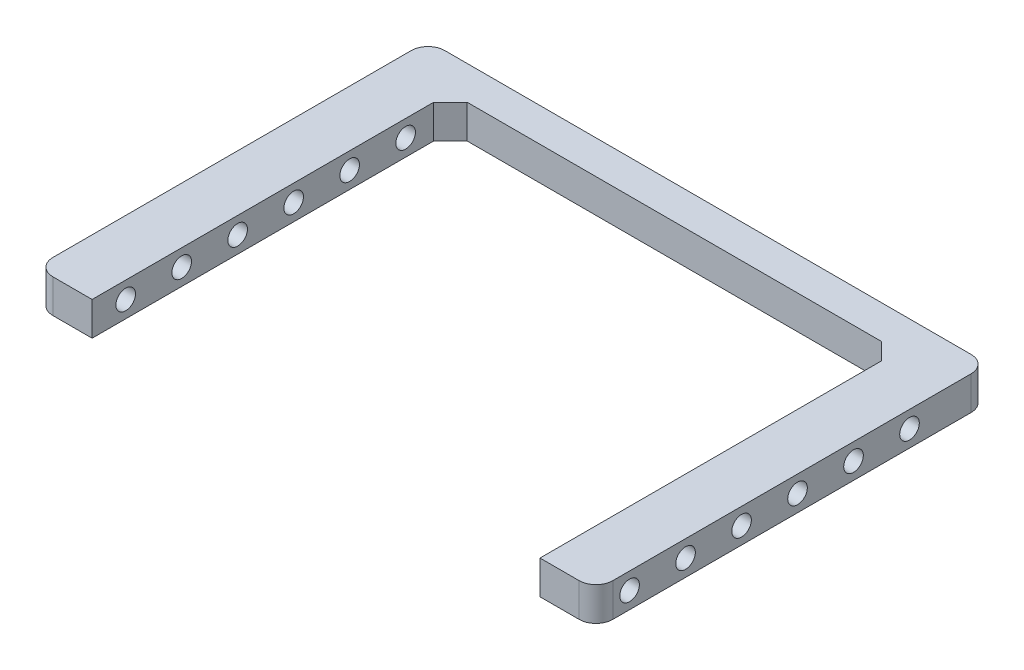
ISO-10303-21;
HEADER;
FILE_DESCRIPTION(('STEP AP214'),'2;1');
FILE_NAME('part.step','',(''),(''),'','','');
FILE_SCHEMA(('AUTOMOTIVE_DESIGN { 1 0 10303 214 1 1 1 1 }'));
ENDSEC;
DATA;
#1=APPLICATION_CONTEXT('core data for automotive mechanical design processes');
#2=APPLICATION_PROTOCOL_DEFINITION('international standard','automotive_design',2000,#1);
#3=PRODUCT_CONTEXT('',#1,'mechanical');
#4=PRODUCT('Part','Part','',(#3));
#5=PRODUCT_RELATED_PRODUCT_CATEGORY('part','',(#4));
#6=PRODUCT_DEFINITION_FORMATION('','',#4);
#7=PRODUCT_DEFINITION_CONTEXT('part definition',#1,'design');
#8=PRODUCT_DEFINITION('design','',#6,#7);
#9=PRODUCT_DEFINITION_SHAPE('','',#8);
#10=(LENGTH_UNIT() NAMED_UNIT(*) SI_UNIT(.MILLI.,.METRE.));
#11=(NAMED_UNIT(*) PLANE_ANGLE_UNIT() SI_UNIT($,.RADIAN.));
#12=(NAMED_UNIT(*) SI_UNIT($,.STERADIAN.) SOLID_ANGLE_UNIT());
#13=UNCERTAINTY_MEASURE_WITH_UNIT(LENGTH_MEASURE(1.E-05),#10,'distance_accuracy_value','');
#14=(GEOMETRIC_REPRESENTATION_CONTEXT(3) GLOBAL_UNCERTAINTY_ASSIGNED_CONTEXT((#13)) GLOBAL_UNIT_ASSIGNED_CONTEXT((#10,
#11,#12)) REPRESENTATION_CONTEXT('',''));
#15=CARTESIAN_POINT('',(0.,0.,0.));
#16=DIRECTION('',(0.,0.,1.));
#17=DIRECTION('',(1.,0.,0.));
#18=AXIS2_PLACEMENT_3D('',#15,#16,#17);
#19=CARTESIAN_POINT('',(25.,3.,21.));
#20=DIRECTION('',(-1.,0.,0.));
#21=DIRECTION('',(0.,0.,1.));
#22=AXIS2_PLACEMENT_3D('',#19,#20,#21);
#23=PLANE('',#22);
#24=CARTESIAN_POINT('',(25.,1.5,-7.));
#25=DIRECTION('',(-1.,0.,0.));
#26=DIRECTION('',(0.,0.,1.));
#27=AXIS2_PLACEMENT_3D('',#24,#25,#26);
#28=CIRCLE('',#27,0.875000000000002);
#29=CARTESIAN_POINT('',(25.,1.5,-6.125));
#30=VERTEX_POINT('',#29);
#31=EDGE_CURVE('E340',#30,#30,#28,.F.);
#32=ORIENTED_EDGE('',*,*,#31,.F.);
#33=EDGE_LOOP('',(#32));
#34=FACE_BOUND('',#33,.T.);
#35=CARTESIAN_POINT('',(25.,1.5,3.));
#36=DIRECTION('',(-1.,0.,0.));
#37=DIRECTION('',(0.,0.,1.));
#38=AXIS2_PLACEMENT_3D('',#35,#36,#37);
#39=CIRCLE('',#38,0.875);
#40=CARTESIAN_POINT('',(25.,1.5,3.875));
#41=VERTEX_POINT('',#40);
#42=EDGE_CURVE('E333',#41,#41,#39,.F.);
#43=ORIENTED_EDGE('',*,*,#42,.F.);
#44=EDGE_LOOP('',(#43));
#45=FACE_BOUND('',#44,.T.);
#46=CARTESIAN_POINT('',(25.,1.5,8.));
#47=DIRECTION('',(-1.,0.,0.));
#48=DIRECTION('',(0.,0.,1.));
#49=AXIS2_PLACEMENT_3D('',#46,#47,#48);
#50=CIRCLE('',#49,0.875);
#51=CARTESIAN_POINT('',(25.,1.5,8.875));
#52=VERTEX_POINT('',#51);
#53=EDGE_CURVE('E326',#52,#52,#50,.F.);
#54=ORIENTED_EDGE('',*,*,#53,.F.);
#55=EDGE_LOOP('',(#54));
#56=FACE_BOUND('',#55,.T.);
#57=CARTESIAN_POINT('',(25.,1.5,13.));
#58=DIRECTION('',(-1.,0.,0.));
#59=DIRECTION('',(0.,0.,1.));
#60=AXIS2_PLACEMENT_3D('',#57,#58,#59);
#61=CIRCLE('',#60,0.875);
#62=CARTESIAN_POINT('',(25.,1.5,13.875));
#63=VERTEX_POINT('',#62);
#64=EDGE_CURVE('E319',#63,#63,#61,.F.);
#65=ORIENTED_EDGE('',*,*,#64,.F.);
#66=EDGE_LOOP('',(#65));
#67=FACE_BOUND('',#66,.T.);
#68=CARTESIAN_POINT('',(25.,1.5,-2.));
#69=DIRECTION('',(-1.,0.,0.));
#70=DIRECTION('',(0.,0.,1.));
#71=AXIS2_PLACEMENT_3D('',#68,#69,#70);
#72=CIRCLE('',#71,0.875);
#73=CARTESIAN_POINT('',(25.,1.5,-1.125));
#74=VERTEX_POINT('',#73);
#75=EDGE_CURVE('E312',#74,#74,#72,.F.);
#76=ORIENTED_EDGE('',*,*,#75,.F.);
#77=EDGE_LOOP('',(#76));
#78=FACE_BOUND('',#77,.T.);
#79=CARTESIAN_POINT('',(25.,1.5,18.));
#80=DIRECTION('',(-1.,0.,0.));
#81=DIRECTION('',(0.,0.,1.));
#82=AXIS2_PLACEMENT_3D('',#79,#80,#81);
#83=CIRCLE('',#82,0.875000000000002);
#84=CARTESIAN_POINT('',(25.,1.5,18.875));
#85=VERTEX_POINT('',#84);
#86=EDGE_CURVE('E174',#85,#85,#83,.F.);
#87=ORIENTED_EDGE('',*,*,#86,.F.);
#88=EDGE_LOOP('',(#87));
#89=FACE_BOUND('',#88,.T.);
#90=DIRECTION('',(0.,0.,-1.));
#91=VECTOR('',#90,1.);
#92=CARTESIAN_POINT('',(25.,0.,21.));
#93=LINE('',#92,#91);
#94=CARTESIAN_POINT('',(25.,0.,19.5));
#95=VERTEX_POINT('',#94);
#96=CARTESIAN_POINT('',(25.,0.,-12.5));
#97=VERTEX_POINT('',#96);
#98=EDGE_CURVE('E170',#95,#97,#93,.T.);
#99=ORIENTED_EDGE('',*,*,#98,.T.);
#100=DIRECTION('',(0.,-1.,0.));
#101=VECTOR('',#100,1.);
#102=CARTESIAN_POINT('',(25.,3.,-12.5));
#103=LINE('',#102,#101);
#104=CARTESIAN_POINT('',(25.,3.,-12.5));
#105=VERTEX_POINT('',#104);
#106=EDGE_CURVE('E239',#97,#105,#103,.F.);
#107=ORIENTED_EDGE('',*,*,#106,.T.);
#108=DIRECTION('',(0.,0.,-1.));
#109=VECTOR('',#108,1.);
#110=CARTESIAN_POINT('',(25.,3.,21.));
#111=LINE('',#110,#109);
#112=CARTESIAN_POINT('',(25.,3.,19.5));
#113=VERTEX_POINT('',#112);
#114=EDGE_CURVE('E191',#113,#105,#111,.T.);
#115=ORIENTED_EDGE('',*,*,#114,.F.);
#116=DIRECTION('',(0.,-1.,0.));
#117=VECTOR('',#116,1.);
#118=CARTESIAN_POINT('',(25.,3.,19.5));
#119=LINE('',#118,#117);
#120=EDGE_CURVE('E236',#113,#95,#119,.T.);
#121=ORIENTED_EDGE('',*,*,#120,.T.);
#122=EDGE_LOOP('',(#99,#107,#115,#121));
#123=FACE_BOUND('',#122,.T.);
#124=ADVANCED_FACE('F32',(#34,#45,#56,#67,#78,#89,#123),#23,.F.);
#125=CARTESIAN_POINT('',(-25.,3.,-14.));
#126=DIRECTION('',(0.,0.,1.));
#127=DIRECTION('',(1.,0.,0.));
#128=AXIS2_PLACEMENT_3D('',#125,#126,#127);
#129=PLANE('',#128);
#130=DIRECTION('',(-1.,0.,0.));
#131=VECTOR('',#130,1.);
#132=CARTESIAN_POINT('',(-25.,3.,-14.));
#133=LINE('',#132,#131);
#134=CARTESIAN_POINT('',(23.5,3.,-14.));
#135=VERTEX_POINT('',#134);
#136=CARTESIAN_POINT('',(-23.5,3.,-14.));
#137=VERTEX_POINT('',#136);
#138=EDGE_CURVE('E301',#135,#137,#133,.T.);
#139=ORIENTED_EDGE('',*,*,#138,.F.);
#140=DIRECTION('',(0.,-1.,0.));
#141=VECTOR('',#140,1.);
#142=CARTESIAN_POINT('',(23.5,3.,-14.));
#143=LINE('',#142,#141);
#144=CARTESIAN_POINT('',(23.5,0.,-14.));
#145=VERTEX_POINT('',#144);
#146=EDGE_CURVE('E225',#135,#145,#143,.T.);
#147=ORIENTED_EDGE('',*,*,#146,.T.);
#148=DIRECTION('',(-1.,0.,0.));
#149=VECTOR('',#148,1.);
#150=CARTESIAN_POINT('',(-25.,0.,-14.));
#151=LINE('',#150,#149);
#152=CARTESIAN_POINT('',(-23.5,0.,-14.));
#153=VERTEX_POINT('',#152);
#154=EDGE_CURVE('E173',#145,#153,#151,.T.);
#155=ORIENTED_EDGE('',*,*,#154,.T.);
#156=DIRECTION('',(0.,-1.,0.));
#157=VECTOR('',#156,1.);
#158=CARTESIAN_POINT('',(-23.5,3.,-14.));
#159=LINE('',#158,#157);
#160=EDGE_CURVE('E154',#153,#137,#159,.F.);
#161=ORIENTED_EDGE('',*,*,#160,.T.);
#162=EDGE_LOOP('',(#139,#147,#155,#161));
#163=FACE_BOUND('',#162,.T.);
#164=ADVANCED_FACE('F298',(#163),#129,.F.);
#165=CARTESIAN_POINT('',(-25.,3.,21.));
#166=DIRECTION('',(1.,0.,0.));
#167=DIRECTION('',(0.,0.,-1.));
#168=AXIS2_PLACEMENT_3D('',#165,#166,#167);
#169=PLANE('',#168);
#170=CARTESIAN_POINT('',(-25.,1.5,-7.));
#171=DIRECTION('',(-1.,0.,0.));
#172=DIRECTION('',(0.,0.,1.));
#173=AXIS2_PLACEMENT_3D('',#170,#171,#172);
#174=CIRCLE('',#173,0.875000000000002);
#175=CARTESIAN_POINT('',(-25.,1.5,-6.125));
#176=VERTEX_POINT('',#175);
#177=EDGE_CURVE('E223',#176,#176,#174,.T.);
#178=ORIENTED_EDGE('',*,*,#177,.F.);
#179=EDGE_LOOP('',(#178));
#180=FACE_BOUND('',#179,.T.);
#181=CARTESIAN_POINT('',(-25.,1.5,3.));
#182=DIRECTION('',(-1.,0.,0.));
#183=DIRECTION('',(0.,0.,1.));
#184=AXIS2_PLACEMENT_3D('',#181,#182,#183);
#185=CIRCLE('',#184,0.875);
#186=CARTESIAN_POINT('',(-25.,1.5,3.875));
#187=VERTEX_POINT('',#186);
#188=EDGE_CURVE('E218',#187,#187,#185,.T.);
#189=ORIENTED_EDGE('',*,*,#188,.F.);
#190=EDGE_LOOP('',(#189));
#191=FACE_BOUND('',#190,.T.);
#192=CARTESIAN_POINT('',(-25.,1.5,8.));
#193=DIRECTION('',(-1.,0.,0.));
#194=DIRECTION('',(0.,0.,1.));
#195=AXIS2_PLACEMENT_3D('',#192,#193,#194);
#196=CIRCLE('',#195,0.875);
#197=CARTESIAN_POINT('',(-25.,1.5,8.875));
#198=VERTEX_POINT('',#197);
#199=EDGE_CURVE('E213',#198,#198,#196,.T.);
#200=ORIENTED_EDGE('',*,*,#199,.F.);
#201=EDGE_LOOP('',(#200));
#202=FACE_BOUND('',#201,.T.);
#203=CARTESIAN_POINT('',(-25.,1.5,13.));
#204=DIRECTION('',(-1.,0.,0.));
#205=DIRECTION('',(0.,0.,1.));
#206=AXIS2_PLACEMENT_3D('',#203,#204,#205);
#207=CIRCLE('',#206,0.875);
#208=CARTESIAN_POINT('',(-25.,1.5,13.875));
#209=VERTEX_POINT('',#208);
#210=EDGE_CURVE('E208',#209,#209,#207,.T.);
#211=ORIENTED_EDGE('',*,*,#210,.F.);
#212=EDGE_LOOP('',(#211));
#213=FACE_BOUND('',#212,.T.);
#214=CARTESIAN_POINT('',(-25.,1.5,-2.));
#215=DIRECTION('',(-1.,0.,0.));
#216=DIRECTION('',(0.,0.,1.));
#217=AXIS2_PLACEMENT_3D('',#214,#215,#216);
#218=CIRCLE('',#217,0.875);
#219=CARTESIAN_POINT('',(-25.,1.5,-1.125));
#220=VERTEX_POINT('',#219);
#221=EDGE_CURVE('E203',#220,#220,#218,.T.);
#222=ORIENTED_EDGE('',*,*,#221,.F.);
#223=EDGE_LOOP('',(#222));
#224=FACE_BOUND('',#223,.T.);
#225=CARTESIAN_POINT('',(-25.,1.5,18.));
#226=DIRECTION('',(-1.,0.,0.));
#227=DIRECTION('',(0.,0.,1.));
#228=AXIS2_PLACEMENT_3D('',#225,#226,#227);
#229=CIRCLE('',#228,0.875000000000002);
#230=CARTESIAN_POINT('',(-25.,1.5,18.875));
#231=VERTEX_POINT('',#230);
#232=EDGE_CURVE('E198',#231,#231,#229,.T.);
#233=ORIENTED_EDGE('',*,*,#232,.F.);
#234=EDGE_LOOP('',(#233));
#235=FACE_BOUND('',#234,.T.);
#236=DIRECTION('',(0.,0.,1.));
#237=VECTOR('',#236,1.);
#238=CARTESIAN_POINT('',(-25.,3.,21.));
#239=LINE('',#238,#237);
#240=CARTESIAN_POINT('',(-25.,3.,-12.5));
#241=VERTEX_POINT('',#240);
#242=CARTESIAN_POINT('',(-25.,3.,19.5));
#243=VERTEX_POINT('',#242);
#244=EDGE_CURVE('E144',#241,#243,#239,.T.);
#245=ORIENTED_EDGE('',*,*,#244,.F.);
#246=DIRECTION('',(0.,-1.,0.));
#247=VECTOR('',#246,1.);
#248=CARTESIAN_POINT('',(-25.,3.,-12.5));
#249=LINE('',#248,#247);
#250=CARTESIAN_POINT('',(-25.,0.,-12.5));
#251=VERTEX_POINT('',#250);
#252=EDGE_CURVE('E252',#241,#251,#249,.T.);
#253=ORIENTED_EDGE('',*,*,#252,.T.);
#254=DIRECTION('',(0.,0.,1.));
#255=VECTOR('',#254,1.);
#256=CARTESIAN_POINT('',(-25.,0.,21.));
#257=LINE('',#256,#255);
#258=CARTESIAN_POINT('',(-25.,0.,19.5));
#259=VERTEX_POINT('',#258);
#260=EDGE_CURVE('E177',#251,#259,#257,.T.);
#261=ORIENTED_EDGE('',*,*,#260,.T.);
#262=DIRECTION('',(0.,-1.,0.));
#263=VECTOR('',#262,1.);
#264=CARTESIAN_POINT('',(-25.,3.,19.5));
#265=LINE('',#264,#263);
#266=EDGE_CURVE('E250',#259,#243,#265,.F.);
#267=ORIENTED_EDGE('',*,*,#266,.T.);
#268=EDGE_LOOP('',(#245,#253,#261,#267));
#269=FACE_BOUND('',#268,.T.);
#270=ADVANCED_FACE('F351',(#180,#191,#202,#213,#224,#235,#269),#169,.F.);
#271=CARTESIAN_POINT('',(-25.,3.,21.));
#272=DIRECTION('',(0.,0.,-1.));
#273=DIRECTION('',(-1.,0.,0.));
#274=AXIS2_PLACEMENT_3D('',#271,#272,#273);
#275=PLANE('',#274);
#276=DIRECTION('',(1.,0.,0.));
#277=VECTOR('',#276,1.);
#278=CARTESIAN_POINT('',(-25.,3.,21.));
#279=LINE('',#278,#277);
#280=CARTESIAN_POINT('',(-23.5,3.,21.));
#281=VERTEX_POINT('',#280);
#282=CARTESIAN_POINT('',(-20.,3.,21.));
#283=VERTEX_POINT('',#282);
#284=EDGE_CURVE('E131',#281,#283,#279,.T.);
#285=ORIENTED_EDGE('',*,*,#284,.F.);
#286=DIRECTION('',(0.,-1.,0.));
#287=VECTOR('',#286,1.);
#288=CARTESIAN_POINT('',(-23.5,3.,21.));
#289=LINE('',#288,#287);
#290=CARTESIAN_POINT('',(-23.5,0.,21.));
#291=VERTEX_POINT('',#290);
#292=EDGE_CURVE('E255',#281,#291,#289,.T.);
#293=ORIENTED_EDGE('',*,*,#292,.T.);
#294=DIRECTION('',(1.,0.,0.));
#295=VECTOR('',#294,1.);
#296=CARTESIAN_POINT('',(-25.,0.,21.));
#297=LINE('',#296,#295);
#298=CARTESIAN_POINT('',(-20.,0.,21.));
#299=VERTEX_POINT('',#298);
#300=EDGE_CURVE('E150',#291,#299,#297,.T.);
#301=ORIENTED_EDGE('',*,*,#300,.T.);
#302=DIRECTION('',(0.,-1.,0.));
#303=VECTOR('',#302,1.);
#304=CARTESIAN_POINT('',(-20.,3.,21.));
#305=LINE('',#304,#303);
#306=EDGE_CURVE('E147',#283,#299,#305,.T.);
#307=ORIENTED_EDGE('',*,*,#306,.F.);
#308=EDGE_LOOP('',(#285,#293,#301,#307));
#309=FACE_BOUND('',#308,.T.);
#310=ADVANCED_FACE('F148',(#309),#275,.F.);
#311=CARTESIAN_POINT('',(-20.,3.,21.));
#312=DIRECTION('',(-1.,0.,0.));
#313=DIRECTION('',(0.,0.,1.));
#314=AXIS2_PLACEMENT_3D('',#311,#312,#313);
#315=PLANE('',#314);
#316=CARTESIAN_POINT('',(-20.,1.5,-7.));
#317=DIRECTION('',(-1.,0.,0.));
#318=DIRECTION('',(0.,0.,1.));
#319=AXIS2_PLACEMENT_3D('',#316,#317,#318);
#320=CIRCLE('',#319,0.875000000000002);
#321=CARTESIAN_POINT('',(-20.,1.5,-6.125));
#322=VERTEX_POINT('',#321);
#323=EDGE_CURVE('E222',#322,#322,#320,.F.);
#324=ORIENTED_EDGE('',*,*,#323,.F.);
#325=EDGE_LOOP('',(#324));
#326=FACE_BOUND('',#325,.T.);
#327=CARTESIAN_POINT('',(-20.,1.5,3.));
#328=DIRECTION('',(-1.,0.,0.));
#329=DIRECTION('',(0.,0.,1.));
#330=AXIS2_PLACEMENT_3D('',#327,#328,#329);
#331=CIRCLE('',#330,0.875);
#332=CARTESIAN_POINT('',(-20.,1.5,3.875));
#333=VERTEX_POINT('',#332);
#334=EDGE_CURVE('E217',#333,#333,#331,.F.);
#335=ORIENTED_EDGE('',*,*,#334,.F.);
#336=EDGE_LOOP('',(#335));
#337=FACE_BOUND('',#336,.T.);
#338=CARTESIAN_POINT('',(-20.,1.5,8.));
#339=DIRECTION('',(-1.,0.,0.));
#340=DIRECTION('',(0.,0.,1.));
#341=AXIS2_PLACEMENT_3D('',#338,#339,#340);
#342=CIRCLE('',#341,0.875);
#343=CARTESIAN_POINT('',(-20.,1.5,8.875));
#344=VERTEX_POINT('',#343);
#345=EDGE_CURVE('E212',#344,#344,#342,.F.);
#346=ORIENTED_EDGE('',*,*,#345,.F.);
#347=EDGE_LOOP('',(#346));
#348=FACE_BOUND('',#347,.T.);
#349=CARTESIAN_POINT('',(-20.,1.5,13.));
#350=DIRECTION('',(-1.,0.,0.));
#351=DIRECTION('',(0.,0.,1.));
#352=AXIS2_PLACEMENT_3D('',#349,#350,#351);
#353=CIRCLE('',#352,0.875);
#354=CARTESIAN_POINT('',(-20.,1.5,13.875));
#355=VERTEX_POINT('',#354);
#356=EDGE_CURVE('E207',#355,#355,#353,.F.);
#357=ORIENTED_EDGE('',*,*,#356,.F.);
#358=EDGE_LOOP('',(#357));
#359=FACE_BOUND('',#358,.T.);
#360=CARTESIAN_POINT('',(-20.,1.5,-2.));
#361=DIRECTION('',(-1.,0.,0.));
#362=DIRECTION('',(0.,0.,1.));
#363=AXIS2_PLACEMENT_3D('',#360,#361,#362);
#364=CIRCLE('',#363,0.875);
#365=CARTESIAN_POINT('',(-20.,1.5,-1.125));
#366=VERTEX_POINT('',#365);
#367=EDGE_CURVE('E202',#366,#366,#364,.F.);
#368=ORIENTED_EDGE('',*,*,#367,.F.);
#369=EDGE_LOOP('',(#368));
#370=FACE_BOUND('',#369,.T.);
#371=CARTESIAN_POINT('',(-20.,1.5,18.));
#372=DIRECTION('',(-1.,0.,0.));
#373=DIRECTION('',(0.,0.,1.));
#374=AXIS2_PLACEMENT_3D('',#371,#372,#373);
#375=CIRCLE('',#374,0.875000000000002);
#376=CARTESIAN_POINT('',(-20.,1.5,18.875));
#377=VERTEX_POINT('',#376);
#378=EDGE_CURVE('E197',#377,#377,#375,.F.);
#379=ORIENTED_EDGE('',*,*,#378,.F.);
#380=EDGE_LOOP('',(#379));
#381=FACE_BOUND('',#380,.T.);
#382=DIRECTION('',(0.,0.,-1.));
#383=VECTOR('',#382,1.);
#384=CARTESIAN_POINT('',(-20.,0.,21.));
#385=LINE('',#384,#383);
#386=CARTESIAN_POINT('',(-20.,0.,-9.50000000000001));
#387=VERTEX_POINT('',#386);
#388=EDGE_CURVE('E181',#299,#387,#385,.T.);
#389=ORIENTED_EDGE('',*,*,#388,.T.);
#390=DIRECTION('',(0.,1.,0.));
#391=VECTOR('',#390,1.);
#392=CARTESIAN_POINT('',(-20.,3.,-9.50000000000001));
#393=LINE('',#392,#391);
#394=CARTESIAN_POINT('',(-20.,3.,-9.50000000000001));
#395=VERTEX_POINT('',#394);
#396=EDGE_CURVE('E159',#387,#395,#393,.T.);
#397=ORIENTED_EDGE('',*,*,#396,.T.);
#398=DIRECTION('',(0.,0.,-1.));
#399=VECTOR('',#398,1.);
#400=CARTESIAN_POINT('',(-20.,3.,21.));
#401=LINE('',#400,#399);
#402=EDGE_CURVE('E136',#283,#395,#401,.T.);
#403=ORIENTED_EDGE('',*,*,#402,.F.);
#404=ORIENTED_EDGE('',*,*,#306,.T.);
#405=EDGE_LOOP('',(#389,#397,#403,#404));
#406=FACE_BOUND('',#405,.T.);
#407=ADVANCED_FACE('F157',(#326,#337,#348,#359,#370,#381,#406),#315,.F.);
#408=CARTESIAN_POINT('',(-20.,3.,-11.));
#409=DIRECTION('',(0.,0.,-1.));
#410=DIRECTION('',(-1.,0.,0.));
#411=AXIS2_PLACEMENT_3D('',#408,#409,#410);
#412=PLANE('',#411);
#413=DIRECTION('',(1.,0.,0.));
#414=VECTOR('',#413,1.);
#415=CARTESIAN_POINT('',(-20.,3.,-11.));
#416=LINE('',#415,#414);
#417=CARTESIAN_POINT('',(-18.5,3.,-11.));
#418=VERTEX_POINT('',#417);
#419=CARTESIAN_POINT('',(18.5,3.,-11.));
#420=VERTEX_POINT('',#419);
#421=EDGE_CURVE('E160',#418,#420,#416,.T.);
#422=ORIENTED_EDGE('',*,*,#421,.F.);
#423=DIRECTION('',(0.,-1.,0.));
#424=VECTOR('',#423,1.);
#425=CARTESIAN_POINT('',(-18.5,0.,-11.));
#426=LINE('',#425,#424);
#427=CARTESIAN_POINT('',(-18.5,0.,-11.));
#428=VERTEX_POINT('',#427);
#429=EDGE_CURVE('E259',#418,#428,#426,.T.);
#430=ORIENTED_EDGE('',*,*,#429,.T.);
#431=DIRECTION('',(1.,0.,0.));
#432=VECTOR('',#431,1.);
#433=CARTESIAN_POINT('',(-20.,0.,-11.));
#434=LINE('',#433,#432);
#435=CARTESIAN_POINT('',(18.5,0.,-11.));
#436=VERTEX_POINT('',#435);
#437=EDGE_CURVE('E183',#428,#436,#434,.T.);
#438=ORIENTED_EDGE('',*,*,#437,.T.);
#439=DIRECTION('',(0.,1.,0.));
#440=VECTOR('',#439,1.);
#441=CARTESIAN_POINT('',(18.5,3.,-11.));
#442=LINE('',#441,#440);
#443=EDGE_CURVE('E257',#436,#420,#442,.T.);
#444=ORIENTED_EDGE('',*,*,#443,.T.);
#445=EDGE_LOOP('',(#422,#430,#438,#444));
#446=FACE_BOUND('',#445,.T.);
#447=ADVANCED_FACE('F276',(#446),#412,.F.);
#448=CARTESIAN_POINT('',(20.,3.,-11.));
#449=DIRECTION('',(1.,0.,0.));
#450=DIRECTION('',(0.,0.,-1.));
#451=AXIS2_PLACEMENT_3D('',#448,#449,#450);
#452=PLANE('',#451);
#453=CARTESIAN_POINT('',(20.,1.5,-7.));
#454=DIRECTION('',(1.,0.,0.));
#455=DIRECTION('',(0.,0.,-1.));
#456=AXIS2_PLACEMENT_3D('',#453,#454,#455);
#457=CIRCLE('',#456,0.875000000000002);
#458=CARTESIAN_POINT('',(20.,1.5,-7.875));
#459=VERTEX_POINT('',#458);
#460=EDGE_CURVE('E219',#459,#459,#457,.F.);
#461=ORIENTED_EDGE('',*,*,#460,.F.);
#462=EDGE_LOOP('',(#461));
#463=FACE_BOUND('',#462,.T.);
#464=CARTESIAN_POINT('',(20.,1.5,3.));
#465=DIRECTION('',(1.,0.,0.));
#466=DIRECTION('',(0.,0.,-1.));
#467=AXIS2_PLACEMENT_3D('',#464,#465,#466);
#468=CIRCLE('',#467,0.875);
#469=CARTESIAN_POINT('',(20.,1.5,2.125));
#470=VERTEX_POINT('',#469);
#471=EDGE_CURVE('E214',#470,#470,#468,.F.);
#472=ORIENTED_EDGE('',*,*,#471,.F.);
#473=EDGE_LOOP('',(#472));
#474=FACE_BOUND('',#473,.T.);
#475=CARTESIAN_POINT('',(20.,1.5,8.));
#476=DIRECTION('',(1.,0.,0.));
#477=DIRECTION('',(0.,0.,-1.));
#478=AXIS2_PLACEMENT_3D('',#475,#476,#477);
#479=CIRCLE('',#478,0.875);
#480=CARTESIAN_POINT('',(20.,1.5,7.125));
#481=VERTEX_POINT('',#480);
#482=EDGE_CURVE('E209',#481,#481,#479,.F.);
#483=ORIENTED_EDGE('',*,*,#482,.F.);
#484=EDGE_LOOP('',(#483));
#485=FACE_BOUND('',#484,.T.);
#486=CARTESIAN_POINT('',(20.,1.5,13.));
#487=DIRECTION('',(1.,0.,0.));
#488=DIRECTION('',(0.,0.,-1.));
#489=AXIS2_PLACEMENT_3D('',#486,#487,#488);
#490=CIRCLE('',#489,0.875);
#491=CARTESIAN_POINT('',(20.,1.5,12.125));
#492=VERTEX_POINT('',#491);
#493=EDGE_CURVE('E204',#492,#492,#490,.F.);
#494=ORIENTED_EDGE('',*,*,#493,.F.);
#495=EDGE_LOOP('',(#494));
#496=FACE_BOUND('',#495,.T.);
#497=CARTESIAN_POINT('',(20.,1.5,-2.));
#498=DIRECTION('',(1.,0.,0.));
#499=DIRECTION('',(0.,0.,-1.));
#500=AXIS2_PLACEMENT_3D('',#497,#498,#499);
#501=CIRCLE('',#500,0.875);
#502=CARTESIAN_POINT('',(20.,1.5,-2.875));
#503=VERTEX_POINT('',#502);
#504=EDGE_CURVE('E199',#503,#503,#501,.F.);
#505=ORIENTED_EDGE('',*,*,#504,.F.);
#506=EDGE_LOOP('',(#505));
#507=FACE_BOUND('',#506,.T.);
#508=CARTESIAN_POINT('',(20.,1.5,18.));
#509=DIRECTION('',(1.,0.,0.));
#510=DIRECTION('',(0.,0.,-1.));
#511=AXIS2_PLACEMENT_3D('',#508,#509,#510);
#512=CIRCLE('',#511,0.875000000000002);
#513=CARTESIAN_POINT('',(20.,1.5,17.125));
#514=VERTEX_POINT('',#513);
#515=EDGE_CURVE('E194',#514,#514,#512,.F.);
#516=ORIENTED_EDGE('',*,*,#515,.F.);
#517=EDGE_LOOP('',(#516));
#518=FACE_BOUND('',#517,.T.);
#519=DIRECTION('',(0.,0.,1.));
#520=VECTOR('',#519,1.);
#521=CARTESIAN_POINT('',(20.,3.,-11.));
#522=LINE('',#521,#520);
#523=CARTESIAN_POINT('',(20.,3.,-9.49999999999998));
#524=VERTEX_POINT('',#523);
#525=CARTESIAN_POINT('',(20.,3.,21.));
#526=VERTEX_POINT('',#525);
#527=EDGE_CURVE('E162',#524,#526,#522,.T.);
#528=ORIENTED_EDGE('',*,*,#527,.F.);
#529=DIRECTION('',(0.,-1.,0.));
#530=VECTOR('',#529,1.);
#531=CARTESIAN_POINT('',(20.,0.,-9.49999999999998));
#532=LINE('',#531,#530);
#533=CARTESIAN_POINT('',(20.,0.,-9.49999999999998));
#534=VERTEX_POINT('',#533);
#535=EDGE_CURVE('E263',#524,#534,#532,.T.);
#536=ORIENTED_EDGE('',*,*,#535,.T.);
#537=DIRECTION('',(0.,0.,1.));
#538=VECTOR('',#537,1.);
#539=CARTESIAN_POINT('',(20.,0.,-11.));
#540=LINE('',#539,#538);
#541=CARTESIAN_POINT('',(20.,0.,21.));
#542=VERTEX_POINT('',#541);
#543=EDGE_CURVE('E186',#534,#542,#540,.T.);
#544=ORIENTED_EDGE('',*,*,#543,.T.);
#545=DIRECTION('',(0.,-1.,0.));
#546=VECTOR('',#545,1.);
#547=CARTESIAN_POINT('',(20.,3.,21.));
#548=LINE('',#547,#546);
#549=EDGE_CURVE('E155',#526,#542,#548,.T.);
#550=ORIENTED_EDGE('',*,*,#549,.F.);
#551=EDGE_LOOP('',(#528,#536,#544,#550));
#552=FACE_BOUND('',#551,.T.);
#553=ADVANCED_FACE('F279',(#463,#474,#485,#496,#507,#518,#552),#452,.F.);
#554=CARTESIAN_POINT('',(20.,3.,21.));
#555=DIRECTION('',(0.,0.,-1.));
#556=DIRECTION('',(-1.,0.,0.));
#557=AXIS2_PLACEMENT_3D('',#554,#555,#556);
#558=PLANE('',#557);
#559=DIRECTION('',(1.,0.,0.));
#560=VECTOR('',#559,1.);
#561=CARTESIAN_POINT('',(20.,0.,21.));
#562=LINE('',#561,#560);
#563=CARTESIAN_POINT('',(23.5,0.,21.));
#564=VERTEX_POINT('',#563);
#565=EDGE_CURVE('E188',#542,#564,#562,.T.);
#566=ORIENTED_EDGE('',*,*,#565,.T.);
#567=DIRECTION('',(0.,-1.,0.));
#568=VECTOR('',#567,1.);
#569=CARTESIAN_POINT('',(23.5,3.,21.));
#570=LINE('',#569,#568);
#571=CARTESIAN_POINT('',(23.5,3.,21.));
#572=VERTEX_POINT('',#571);
#573=EDGE_CURVE('E248',#564,#572,#570,.F.);
#574=ORIENTED_EDGE('',*,*,#573,.T.);
#575=DIRECTION('',(1.,0.,0.));
#576=VECTOR('',#575,1.);
#577=CARTESIAN_POINT('',(20.,3.,21.));
#578=LINE('',#577,#576);
#579=EDGE_CURVE('E167',#526,#572,#578,.T.);
#580=ORIENTED_EDGE('',*,*,#579,.F.);
#581=ORIENTED_EDGE('',*,*,#549,.T.);
#582=EDGE_LOOP('',(#566,#574,#580,#581));
#583=FACE_BOUND('',#582,.T.);
#584=ADVANCED_FACE('F433',(#583),#558,.F.);
#585=CARTESIAN_POINT('',(0.,3.,0.));
#586=DIRECTION('',(0.,-1.,0.));
#587=DIRECTION('',(0.,0.,-1.));
#588=AXIS2_PLACEMENT_3D('',#585,#586,#587);
#589=PLANE('',#588);
#590=ORIENTED_EDGE('',*,*,#114,.T.);
#591=CARTESIAN_POINT('',(23.5,3.,-12.5));
#592=DIRECTION('',(0.,-1.,0.));
#593=DIRECTION('',(0.,0.,-1.));
#594=AXIS2_PLACEMENT_3D('',#591,#592,#593);
#595=CIRCLE('',#594,1.5);
#596=EDGE_CURVE('E246',#105,#135,#595,.F.);
#597=ORIENTED_EDGE('',*,*,#596,.T.);
#598=ORIENTED_EDGE('',*,*,#138,.T.);
#599=CARTESIAN_POINT('',(-23.5,3.,-12.5));
#600=DIRECTION('',(0.,-1.,0.));
#601=DIRECTION('',(0.,0.,-1.));
#602=AXIS2_PLACEMENT_3D('',#599,#600,#601);
#603=CIRCLE('',#602,1.5);
#604=EDGE_CURVE('E242',#137,#241,#603,.F.);
#605=ORIENTED_EDGE('',*,*,#604,.T.);
#606=ORIENTED_EDGE('',*,*,#244,.T.);
#607=CARTESIAN_POINT('',(-23.5,3.,19.5));
#608=DIRECTION('',(0.,-1.,0.));
#609=DIRECTION('',(0.,0.,-1.));
#610=AXIS2_PLACEMENT_3D('',#607,#608,#609);
#611=CIRCLE('',#610,1.5);
#612=EDGE_CURVE('E140',#243,#281,#611,.F.);
#613=ORIENTED_EDGE('',*,*,#612,.T.);
#614=ORIENTED_EDGE('',*,*,#284,.T.);
#615=ORIENTED_EDGE('',*,*,#402,.T.);
#616=DIRECTION('',(-0.707106781186552,0.,0.707106781186543));
#617=VECTOR('',#616,1.);
#618=CARTESIAN_POINT('',(-14.7499999999999,3.,-14.7500000000001));
#619=LINE('',#618,#617);
#620=EDGE_CURVE('E267',#395,#418,#619,.F.);
#621=ORIENTED_EDGE('',*,*,#620,.T.);
#622=ORIENTED_EDGE('',*,*,#421,.T.);
#623=DIRECTION('',(-0.707106781186543,0.,-0.707106781186552));
#624=VECTOR('',#623,1.);
#625=CARTESIAN_POINT('',(14.7500000000001,3.,-14.7499999999999));
#626=LINE('',#625,#624);
#627=EDGE_CURVE('E11',#420,#524,#626,.F.);
#628=ORIENTED_EDGE('',*,*,#627,.T.);
#629=ORIENTED_EDGE('',*,*,#527,.T.);
#630=ORIENTED_EDGE('',*,*,#579,.T.);
#631=CARTESIAN_POINT('',(23.5,3.,19.5));
#632=DIRECTION('',(0.,-1.,0.));
#633=DIRECTION('',(0.,0.,-1.));
#634=AXIS2_PLACEMENT_3D('',#631,#632,#633);
#635=CIRCLE('',#634,1.5);
#636=EDGE_CURVE('E244',#572,#113,#635,.F.);
#637=ORIENTED_EDGE('',*,*,#636,.T.);
#638=EDGE_LOOP('',(#590,#597,#598,#605,#606,#613,#614,#615,#621,#622,#628,#629,#630,#637));
#639=FACE_BOUND('',#638,.T.);
#640=ADVANCED_FACE('F134',(#639),#589,.F.);
#641=CARTESIAN_POINT('',(0.,0.,0.));
#642=DIRECTION('',(0.,-1.,0.));
#643=DIRECTION('',(0.,0.,-1.));
#644=AXIS2_PLACEMENT_3D('',#641,#642,#643);
#645=PLANE('',#644);
#646=ORIENTED_EDGE('',*,*,#154,.F.);
#647=CARTESIAN_POINT('',(23.5,0.,-12.5));
#648=DIRECTION('',(0.,-1.,0.));
#649=DIRECTION('',(0.,0.,-1.));
#650=AXIS2_PLACEMENT_3D('',#647,#648,#649);
#651=CIRCLE('',#650,1.5);
#652=EDGE_CURVE('E234',#145,#97,#651,.T.);
#653=ORIENTED_EDGE('',*,*,#652,.T.);
#654=ORIENTED_EDGE('',*,*,#98,.F.);
#655=CARTESIAN_POINT('',(23.5,0.,19.5));
#656=DIRECTION('',(0.,-1.,0.));
#657=DIRECTION('',(0.,0.,-1.));
#658=AXIS2_PLACEMENT_3D('',#655,#656,#657);
#659=CIRCLE('',#658,1.5);
#660=EDGE_CURVE('E232',#95,#564,#659,.T.);
#661=ORIENTED_EDGE('',*,*,#660,.T.);
#662=ORIENTED_EDGE('',*,*,#565,.F.);
#663=ORIENTED_EDGE('',*,*,#543,.F.);
#664=DIRECTION('',(0.707106781186543,0.,0.707106781186552));
#665=VECTOR('',#664,1.);
#666=CARTESIAN_POINT('',(20.,0.,-9.49999999999998));
#667=LINE('',#666,#665);
#668=EDGE_CURVE('E40',#534,#436,#667,.F.);
#669=ORIENTED_EDGE('',*,*,#668,.T.);
#670=ORIENTED_EDGE('',*,*,#437,.F.);
#671=DIRECTION('',(0.707106781186552,0.,-0.707106781186543));
#672=VECTOR('',#671,1.);
#673=CARTESIAN_POINT('',(-18.5,0.,-11.));
#674=LINE('',#673,#672);
#675=EDGE_CURVE('E265',#428,#387,#674,.F.);
#676=ORIENTED_EDGE('',*,*,#675,.T.);
#677=ORIENTED_EDGE('',*,*,#388,.F.);
#678=ORIENTED_EDGE('',*,*,#300,.F.);
#679=CARTESIAN_POINT('',(-23.5,0.,19.5));
#680=DIRECTION('',(0.,-1.,0.));
#681=DIRECTION('',(0.,0.,-1.));
#682=AXIS2_PLACEMENT_3D('',#679,#680,#681);
#683=CIRCLE('',#682,1.5);
#684=EDGE_CURVE('E228',#291,#259,#683,.T.);
#685=ORIENTED_EDGE('',*,*,#684,.T.);
#686=ORIENTED_EDGE('',*,*,#260,.F.);
#687=CARTESIAN_POINT('',(-23.5,0.,-12.5));
#688=DIRECTION('',(0.,-1.,0.));
#689=DIRECTION('',(0.,0.,-1.));
#690=AXIS2_PLACEMENT_3D('',#687,#688,#689);
#691=CIRCLE('',#690,1.5);
#692=EDGE_CURVE('E230',#251,#153,#691,.T.);
#693=ORIENTED_EDGE('',*,*,#692,.T.);
#694=EDGE_LOOP('',(#646,#653,#654,#661,#662,#663,#669,#670,#676,#677,#678,#685,#686,#693));
#695=FACE_BOUND('',#694,.T.);
#696=ADVANCED_FACE('F272',(#695),#645,.T.);
#697=CARTESIAN_POINT('',(-25.,1.5,18.));
#698=DIRECTION('',(1.,0.,0.));
#699=DIRECTION('',(0.,0.,-1.));
#700=AXIS2_PLACEMENT_3D('',#697,#698,#699);
#701=CYLINDRICAL_SURFACE('',#700,0.875000000000002);
#702=ORIENTED_EDGE('',*,*,#515,.T.);
#703=EDGE_LOOP('',(#702));
#704=FACE_BOUND('',#703,.T.);
#705=ORIENTED_EDGE('',*,*,#86,.T.);
#706=EDGE_LOOP('',(#705));
#707=FACE_BOUND('',#706,.T.);
#708=ADVANCED_FACE('F452',(#704,#707),#701,.F.);
#709=ORIENTED_EDGE('',*,*,#232,.T.);
#710=EDGE_LOOP('',(#709));
#711=FACE_BOUND('',#710,.T.);
#712=ORIENTED_EDGE('',*,*,#378,.T.);
#713=EDGE_LOOP('',(#712));
#714=FACE_BOUND('',#713,.T.);
#715=ADVANCED_FACE('F471',(#711,#714),#701,.F.);
#716=CARTESIAN_POINT('',(-25.,1.5,-2.));
#717=DIRECTION('',(1.,0.,0.));
#718=DIRECTION('',(0.,0.,-1.));
#719=AXIS2_PLACEMENT_3D('',#716,#717,#718);
#720=CYLINDRICAL_SURFACE('',#719,0.875);
#721=ORIENTED_EDGE('',*,*,#504,.T.);
#722=EDGE_LOOP('',(#721));
#723=FACE_BOUND('',#722,.T.);
#724=ORIENTED_EDGE('',*,*,#75,.T.);
#725=EDGE_LOOP('',(#724));
#726=FACE_BOUND('',#725,.T.);
#727=ADVANCED_FACE('F478',(#723,#726),#720,.F.);
#728=ORIENTED_EDGE('',*,*,#221,.T.);
#729=EDGE_LOOP('',(#728));
#730=FACE_BOUND('',#729,.T.);
#731=ORIENTED_EDGE('',*,*,#367,.T.);
#732=EDGE_LOOP('',(#731));
#733=FACE_BOUND('',#732,.T.);
#734=ADVANCED_FACE('F485',(#730,#733),#720,.F.);
#735=CARTESIAN_POINT('',(-25.,1.5,13.));
#736=DIRECTION('',(1.,0.,0.));
#737=DIRECTION('',(0.,0.,-1.));
#738=AXIS2_PLACEMENT_3D('',#735,#736,#737);
#739=CYLINDRICAL_SURFACE('',#738,0.875);
#740=ORIENTED_EDGE('',*,*,#493,.T.);
#741=EDGE_LOOP('',(#740));
#742=FACE_BOUND('',#741,.T.);
#743=ORIENTED_EDGE('',*,*,#64,.T.);
#744=EDGE_LOOP('',(#743));
#745=FACE_BOUND('',#744,.T.);
#746=ADVANCED_FACE('F493',(#742,#745),#739,.F.);
#747=ORIENTED_EDGE('',*,*,#210,.T.);
#748=EDGE_LOOP('',(#747));
#749=FACE_BOUND('',#748,.T.);
#750=ORIENTED_EDGE('',*,*,#356,.T.);
#751=EDGE_LOOP('',(#750));
#752=FACE_BOUND('',#751,.T.);
#753=ADVANCED_FACE('F500',(#749,#752),#739,.F.);
#754=CARTESIAN_POINT('',(-25.,1.5,8.));
#755=DIRECTION('',(1.,0.,0.));
#756=DIRECTION('',(0.,0.,-1.));
#757=AXIS2_PLACEMENT_3D('',#754,#755,#756);
#758=CYLINDRICAL_SURFACE('',#757,0.875);
#759=ORIENTED_EDGE('',*,*,#482,.T.);
#760=EDGE_LOOP('',(#759));
#761=FACE_BOUND('',#760,.T.);
#762=ORIENTED_EDGE('',*,*,#53,.T.);
#763=EDGE_LOOP('',(#762));
#764=FACE_BOUND('',#763,.T.);
#765=ADVANCED_FACE('F508',(#761,#764),#758,.F.);
#766=ORIENTED_EDGE('',*,*,#199,.T.);
#767=EDGE_LOOP('',(#766));
#768=FACE_BOUND('',#767,.T.);
#769=ORIENTED_EDGE('',*,*,#345,.T.);
#770=EDGE_LOOP('',(#769));
#771=FACE_BOUND('',#770,.T.);
#772=ADVANCED_FACE('F515',(#768,#771),#758,.F.);
#773=CARTESIAN_POINT('',(-25.,1.5,3.));
#774=DIRECTION('',(1.,0.,0.));
#775=DIRECTION('',(0.,0.,-1.));
#776=AXIS2_PLACEMENT_3D('',#773,#774,#775);
#777=CYLINDRICAL_SURFACE('',#776,0.875);
#778=ORIENTED_EDGE('',*,*,#471,.T.);
#779=EDGE_LOOP('',(#778));
#780=FACE_BOUND('',#779,.T.);
#781=ORIENTED_EDGE('',*,*,#42,.T.);
#782=EDGE_LOOP('',(#781));
#783=FACE_BOUND('',#782,.T.);
#784=ADVANCED_FACE('F523',(#780,#783),#777,.F.);
#785=ORIENTED_EDGE('',*,*,#188,.T.);
#786=EDGE_LOOP('',(#785));
#787=FACE_BOUND('',#786,.T.);
#788=ORIENTED_EDGE('',*,*,#334,.T.);
#789=EDGE_LOOP('',(#788));
#790=FACE_BOUND('',#789,.T.);
#791=ADVANCED_FACE('F530',(#787,#790),#777,.F.);
#792=CARTESIAN_POINT('',(-25.,1.5,-7.));
#793=DIRECTION('',(1.,0.,0.));
#794=DIRECTION('',(0.,0.,-1.));
#795=AXIS2_PLACEMENT_3D('',#792,#793,#794);
#796=CYLINDRICAL_SURFACE('',#795,0.875000000000002);
#797=ORIENTED_EDGE('',*,*,#460,.T.);
#798=EDGE_LOOP('',(#797));
#799=FACE_BOUND('',#798,.T.);
#800=ORIENTED_EDGE('',*,*,#31,.T.);
#801=EDGE_LOOP('',(#800));
#802=FACE_BOUND('',#801,.T.);
#803=ADVANCED_FACE('F538',(#799,#802),#796,.F.);
#804=ORIENTED_EDGE('',*,*,#177,.T.);
#805=EDGE_LOOP('',(#804));
#806=FACE_BOUND('',#805,.T.);
#807=ORIENTED_EDGE('',*,*,#323,.T.);
#808=EDGE_LOOP('',(#807));
#809=FACE_BOUND('',#808,.T.);
#810=ADVANCED_FACE('F348',(#806,#809),#796,.F.);
#811=CARTESIAN_POINT('',(23.5,3.,-12.5));
#812=DIRECTION('',(0.,-1.,0.));
#813=DIRECTION('',(0.,0.,-1.));
#814=AXIS2_PLACEMENT_3D('',#811,#812,#813);
#815=CYLINDRICAL_SURFACE('',#814,1.5);
#816=ORIENTED_EDGE('',*,*,#596,.F.);
#817=ORIENTED_EDGE('',*,*,#106,.F.);
#818=ORIENTED_EDGE('',*,*,#652,.F.);
#819=ORIENTED_EDGE('',*,*,#146,.F.);
#820=EDGE_LOOP('',(#816,#817,#818,#819));
#821=FACE_BOUND('',#820,.T.);
#822=ADVANCED_FACE('F295',(#821),#815,.T.);
#823=CARTESIAN_POINT('',(23.5,3.,19.5));
#824=DIRECTION('',(0.,-1.,0.));
#825=DIRECTION('',(0.,0.,-1.));
#826=AXIS2_PLACEMENT_3D('',#823,#824,#825);
#827=CYLINDRICAL_SURFACE('',#826,1.5);
#828=ORIENTED_EDGE('',*,*,#636,.F.);
#829=ORIENTED_EDGE('',*,*,#573,.F.);
#830=ORIENTED_EDGE('',*,*,#660,.F.);
#831=ORIENTED_EDGE('',*,*,#120,.F.);
#832=EDGE_LOOP('',(#828,#829,#830,#831));
#833=FACE_BOUND('',#832,.T.);
#834=ADVANCED_FACE('F288',(#833),#827,.T.);
#835=CARTESIAN_POINT('',(-23.5,3.,-12.5));
#836=DIRECTION('',(0.,-1.,0.));
#837=DIRECTION('',(0.,0.,-1.));
#838=AXIS2_PLACEMENT_3D('',#835,#836,#837);
#839=CYLINDRICAL_SURFACE('',#838,1.5);
#840=ORIENTED_EDGE('',*,*,#604,.F.);
#841=ORIENTED_EDGE('',*,*,#160,.F.);
#842=ORIENTED_EDGE('',*,*,#692,.F.);
#843=ORIENTED_EDGE('',*,*,#252,.F.);
#844=EDGE_LOOP('',(#840,#841,#842,#843));
#845=FACE_BOUND('',#844,.T.);
#846=ADVANCED_FACE('F370',(#845),#839,.T.);
#847=CARTESIAN_POINT('',(-23.5,3.,19.5));
#848=DIRECTION('',(0.,-1.,0.));
#849=DIRECTION('',(0.,0.,-1.));
#850=AXIS2_PLACEMENT_3D('',#847,#848,#849);
#851=CYLINDRICAL_SURFACE('',#850,1.5);
#852=ORIENTED_EDGE('',*,*,#612,.F.);
#853=ORIENTED_EDGE('',*,*,#266,.F.);
#854=ORIENTED_EDGE('',*,*,#684,.F.);
#855=ORIENTED_EDGE('',*,*,#292,.F.);
#856=EDGE_LOOP('',(#852,#853,#854,#855));
#857=FACE_BOUND('',#856,.T.);
#858=ADVANCED_FACE('F372',(#857),#851,.T.);
#859=CARTESIAN_POINT('',(-18.5,3.,-11.));
#860=DIRECTION('',(0.707106781186543,0.,0.707106781186552));
#861=DIRECTION('',(0.,1.,0.));
#862=AXIS2_PLACEMENT_3D('',#859,#860,#861);
#863=PLANE('',#862);
#864=ORIENTED_EDGE('',*,*,#620,.F.);
#865=ORIENTED_EDGE('',*,*,#396,.F.);
#866=ORIENTED_EDGE('',*,*,#675,.F.);
#867=ORIENTED_EDGE('',*,*,#429,.F.);
#868=EDGE_LOOP('',(#864,#865,#866,#867));
#869=FACE_BOUND('',#868,.T.);
#870=ADVANCED_FACE('F374',(#869),#863,.T.);
#871=CARTESIAN_POINT('',(20.,3.,-9.49999999999998));
#872=DIRECTION('',(-0.707106781186552,0.,0.707106781186543));
#873=DIRECTION('',(0.,1.,0.));
#874=AXIS2_PLACEMENT_3D('',#871,#872,#873);
#875=PLANE('',#874);
#876=ORIENTED_EDGE('',*,*,#627,.F.);
#877=ORIENTED_EDGE('',*,*,#443,.F.);
#878=ORIENTED_EDGE('',*,*,#668,.F.);
#879=ORIENTED_EDGE('',*,*,#535,.F.);
#880=EDGE_LOOP('',(#876,#877,#878,#879));
#881=FACE_BOUND('',#880,.T.);
#882=ADVANCED_FACE('F34',(#881),#875,.T.);
#883=CLOSED_SHELL('',(#124,#164,#270,#310,#407,#447,#553,#584,#640,#696,#708,#715,#727,#734,
#746,#753,#765,#772,#784,#791,#803,#810,#822,#834,#846,#858,#870,#882));
#884=MANIFOLD_SOLID_BREP('B2',#883);
#885=ADVANCED_BREP_SHAPE_REPRESENTATION('',(#18,#884),#14);
#886=SHAPE_DEFINITION_REPRESENTATION(#9,#885);
ENDSEC;
END-ISO-10303-21;
